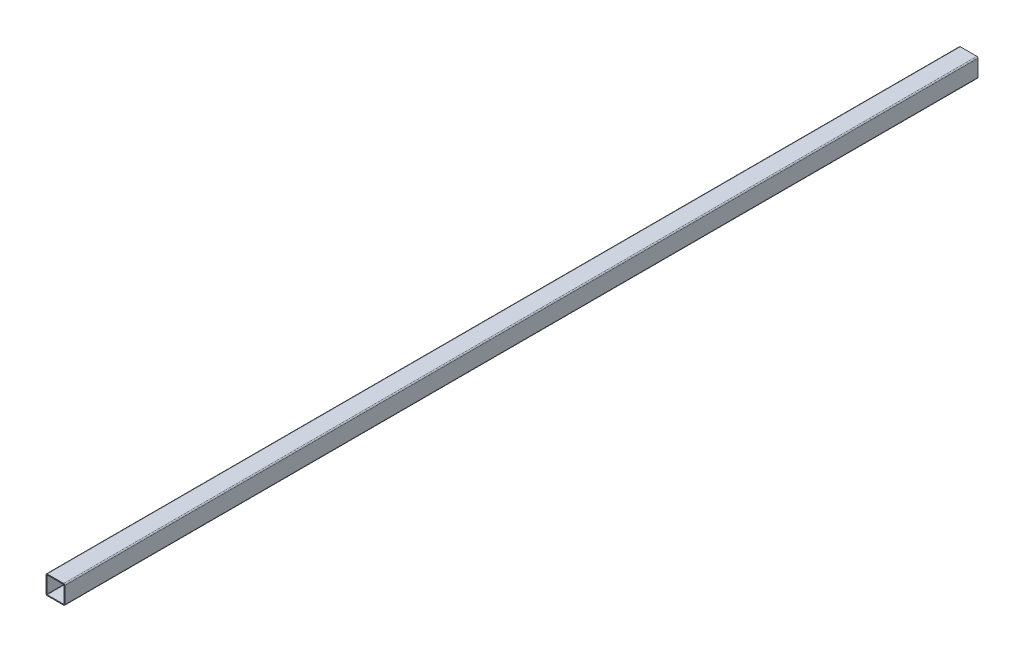
ISO-10303-21;
HEADER;
FILE_DESCRIPTION(('STEP AP214'),'2;1');
FILE_NAME('part.step','',(''),(''),'','','');
FILE_SCHEMA(('AUTOMOTIVE_DESIGN { 1 0 10303 214 1 1 1 1 }'));
ENDSEC;
DATA;
#1=APPLICATION_CONTEXT('core data for automotive mechanical design processes');
#2=APPLICATION_PROTOCOL_DEFINITION('international standard','automotive_design',2000,#1);
#3=PRODUCT_CONTEXT('',#1,'mechanical');
#4=PRODUCT('Part','Part','',(#3));
#5=PRODUCT_RELATED_PRODUCT_CATEGORY('part','',(#4));
#6=PRODUCT_DEFINITION_FORMATION('','',#4);
#7=PRODUCT_DEFINITION_CONTEXT('part definition',#1,'design');
#8=PRODUCT_DEFINITION('design','',#6,#7);
#9=PRODUCT_DEFINITION_SHAPE('','',#8);
#10=(LENGTH_UNIT() NAMED_UNIT(*) SI_UNIT(.MILLI.,.METRE.));
#11=(NAMED_UNIT(*) PLANE_ANGLE_UNIT() SI_UNIT($,.RADIAN.));
#12=(NAMED_UNIT(*) SI_UNIT($,.STERADIAN.) SOLID_ANGLE_UNIT());
#13=UNCERTAINTY_MEASURE_WITH_UNIT(LENGTH_MEASURE(1.E-05),#10,'distance_accuracy_value','');
#14=(GEOMETRIC_REPRESENTATION_CONTEXT(3) GLOBAL_UNCERTAINTY_ASSIGNED_CONTEXT((#13)) GLOBAL_UNIT_ASSIGNED_CONTEXT((#10,
#11,#12)) REPRESENTATION_CONTEXT('',''));
#15=CARTESIAN_POINT('',(0.,0.,0.));
#16=DIRECTION('',(0.,0.,1.));
#17=DIRECTION('',(1.,0.,0.));
#18=AXIS2_PLACEMENT_3D('',#15,#16,#17);
#19=CARTESIAN_POINT('',(14.,-14.,-774.));
#20=DIRECTION('',(0.,0.,1.));
#21=DIRECTION('',(1.,0.,0.));
#22=AXIS2_PLACEMENT_3D('',#19,#20,#21);
#23=CYLINDRICAL_SURFACE('',#22,2.);
#24=DIRECTION('',(0.,0.,1.));
#25=VECTOR('',#24,1.);
#26=CARTESIAN_POINT('',(16.,-14.,-774.));
#27=LINE('',#26,#25);
#28=CARTESIAN_POINT('',(16.,-14.,-774.));
#29=VERTEX_POINT('',#28);
#30=CARTESIAN_POINT('',(16.,-14.,774.));
#31=VERTEX_POINT('',#30);
#32=EDGE_CURVE('E37',#29,#31,#27,.T.);
#33=ORIENTED_EDGE('',*,*,#32,.T.);
#34=CARTESIAN_POINT('',(14.,-14.,774.));
#35=DIRECTION('',(0.,0.,1.));
#36=DIRECTION('',(1.,0.,0.));
#37=AXIS2_PLACEMENT_3D('',#34,#35,#36);
#38=CIRCLE('',#37,2.);
#39=CARTESIAN_POINT('',(14.,-16.,774.));
#40=VERTEX_POINT('',#39);
#41=EDGE_CURVE('E190',#40,#31,#38,.T.);
#42=ORIENTED_EDGE('',*,*,#41,.F.);
#43=DIRECTION('',(0.,0.,1.));
#44=VECTOR('',#43,1.);
#45=CARTESIAN_POINT('',(14.,-16.,-774.));
#46=LINE('',#45,#44);
#47=CARTESIAN_POINT('',(14.,-16.,-774.));
#48=VERTEX_POINT('',#47);
#49=EDGE_CURVE('E11',#48,#40,#46,.T.);
#50=ORIENTED_EDGE('',*,*,#49,.F.);
#51=CARTESIAN_POINT('',(14.,-14.,-774.));
#52=DIRECTION('',(0.,0.,1.));
#53=DIRECTION('',(1.,0.,0.));
#54=AXIS2_PLACEMENT_3D('',#51,#52,#53);
#55=CIRCLE('',#54,2.);
#56=EDGE_CURVE('E233',#48,#29,#55,.T.);
#57=ORIENTED_EDGE('',*,*,#56,.T.);
#58=EDGE_LOOP('',(#33,#42,#50,#57));
#59=FACE_BOUND('',#58,.T.);
#60=ADVANCED_FACE('F34',(#59),#23,.T.);
#61=CARTESIAN_POINT('',(-14.,-16.,-774.));
#62=DIRECTION('',(0.,-1.,0.));
#63=DIRECTION('',(0.,0.,-1.));
#64=AXIS2_PLACEMENT_3D('',#61,#62,#63);
#65=PLANE('',#64);
#66=ORIENTED_EDGE('',*,*,#49,.T.);
#67=DIRECTION('',(1.,0.,0.));
#68=VECTOR('',#67,1.);
#69=CARTESIAN_POINT('',(-14.,-16.,774.));
#70=LINE('',#69,#68);
#71=CARTESIAN_POINT('',(-14.,-16.,774.));
#72=VERTEX_POINT('',#71);
#73=EDGE_CURVE('E211',#72,#40,#70,.T.);
#74=ORIENTED_EDGE('',*,*,#73,.F.);
#75=DIRECTION('',(0.,0.,1.));
#76=VECTOR('',#75,1.);
#77=CARTESIAN_POINT('',(-14.,-16.,-774.));
#78=LINE('',#77,#76);
#79=CARTESIAN_POINT('',(-14.,-16.,-774.));
#80=VERTEX_POINT('',#79);
#81=EDGE_CURVE('E42',#80,#72,#78,.T.);
#82=ORIENTED_EDGE('',*,*,#81,.F.);
#83=DIRECTION('',(1.,0.,0.));
#84=VECTOR('',#83,1.);
#85=CARTESIAN_POINT('',(-14.,-16.,-774.));
#86=LINE('',#85,#84);
#87=EDGE_CURVE('E264',#80,#48,#86,.T.);
#88=ORIENTED_EDGE('',*,*,#87,.T.);
#89=EDGE_LOOP('',(#66,#74,#82,#88));
#90=FACE_BOUND('',#89,.T.);
#91=ADVANCED_FACE('F285',(#90),#65,.T.);
#92=CARTESIAN_POINT('',(-14.,-14.,-774.));
#93=DIRECTION('',(0.,0.,1.));
#94=DIRECTION('',(1.,0.,0.));
#95=AXIS2_PLACEMENT_3D('',#92,#93,#94);
#96=CYLINDRICAL_SURFACE('',#95,2.);
#97=ORIENTED_EDGE('',*,*,#81,.T.);
#98=CARTESIAN_POINT('',(-14.,-14.,774.));
#99=DIRECTION('',(0.,0.,1.));
#100=DIRECTION('',(1.,0.,0.));
#101=AXIS2_PLACEMENT_3D('',#98,#99,#100);
#102=CIRCLE('',#101,2.);
#103=CARTESIAN_POINT('',(-16.,-14.,774.));
#104=VERTEX_POINT('',#103);
#105=EDGE_CURVE('E208',#104,#72,#102,.T.);
#106=ORIENTED_EDGE('',*,*,#105,.F.);
#107=DIRECTION('',(0.,0.,1.));
#108=VECTOR('',#107,1.);
#109=CARTESIAN_POINT('',(-16.,-14.,-774.));
#110=LINE('',#109,#108);
#111=CARTESIAN_POINT('',(-16.,-14.,-774.));
#112=VERTEX_POINT('',#111);
#113=EDGE_CURVE('E268',#112,#104,#110,.T.);
#114=ORIENTED_EDGE('',*,*,#113,.F.);
#115=CARTESIAN_POINT('',(-14.,-14.,-774.));
#116=DIRECTION('',(0.,0.,1.));
#117=DIRECTION('',(1.,0.,0.));
#118=AXIS2_PLACEMENT_3D('',#115,#116,#117);
#119=CIRCLE('',#118,2.);
#120=EDGE_CURVE('E261',#112,#80,#119,.T.);
#121=ORIENTED_EDGE('',*,*,#120,.T.);
#122=EDGE_LOOP('',(#97,#106,#114,#121));
#123=FACE_BOUND('',#122,.T.);
#124=ADVANCED_FACE('F306',(#123),#96,.T.);
#125=CARTESIAN_POINT('',(-16.,-14.,-774.));
#126=DIRECTION('',(-1.,0.,0.));
#127=DIRECTION('',(0.,0.,1.));
#128=AXIS2_PLACEMENT_3D('',#125,#126,#127);
#129=PLANE('',#128);
#130=ORIENTED_EDGE('',*,*,#113,.T.);
#131=DIRECTION('',(0.,-1.,0.));
#132=VECTOR('',#131,1.);
#133=CARTESIAN_POINT('',(-16.,-14.,774.));
#134=LINE('',#133,#132);
#135=CARTESIAN_POINT('',(-16.,14.,774.));
#136=VERTEX_POINT('',#135);
#137=EDGE_CURVE('E205',#136,#104,#134,.T.);
#138=ORIENTED_EDGE('',*,*,#137,.F.);
#139=DIRECTION('',(0.,0.,1.));
#140=VECTOR('',#139,1.);
#141=CARTESIAN_POINT('',(-16.,14.,-774.));
#142=LINE('',#141,#140);
#143=CARTESIAN_POINT('',(-16.,14.,-774.));
#144=VERTEX_POINT('',#143);
#145=EDGE_CURVE('E270',#144,#136,#142,.T.);
#146=ORIENTED_EDGE('',*,*,#145,.F.);
#147=DIRECTION('',(0.,-1.,0.));
#148=VECTOR('',#147,1.);
#149=CARTESIAN_POINT('',(-16.,-14.,-774.));
#150=LINE('',#149,#148);
#151=EDGE_CURVE('E258',#144,#112,#150,.T.);
#152=ORIENTED_EDGE('',*,*,#151,.T.);
#153=EDGE_LOOP('',(#130,#138,#146,#152));
#154=FACE_BOUND('',#153,.T.);
#155=ADVANCED_FACE('F303',(#154),#129,.T.);
#156=CARTESIAN_POINT('',(-14.,14.,-774.));
#157=DIRECTION('',(0.,0.,1.));
#158=DIRECTION('',(1.,0.,0.));
#159=AXIS2_PLACEMENT_3D('',#156,#157,#158);
#160=CYLINDRICAL_SURFACE('',#159,2.);
#161=ORIENTED_EDGE('',*,*,#145,.T.);
#162=CARTESIAN_POINT('',(-14.,14.,774.));
#163=DIRECTION('',(0.,0.,1.));
#164=DIRECTION('',(-1.,0.,0.));
#165=AXIS2_PLACEMENT_3D('',#162,#163,#164);
#166=CIRCLE('',#165,2.);
#167=CARTESIAN_POINT('',(-14.,16.,774.));
#168=VERTEX_POINT('',#167);
#169=EDGE_CURVE('E202',#168,#136,#166,.T.);
#170=ORIENTED_EDGE('',*,*,#169,.F.);
#171=DIRECTION('',(0.,0.,1.));
#172=VECTOR('',#171,1.);
#173=CARTESIAN_POINT('',(-14.,16.,-774.));
#174=LINE('',#173,#172);
#175=CARTESIAN_POINT('',(-14.,16.,-774.));
#176=VERTEX_POINT('',#175);
#177=EDGE_CURVE('E272',#176,#168,#174,.T.);
#178=ORIENTED_EDGE('',*,*,#177,.F.);
#179=CARTESIAN_POINT('',(-14.,14.,-774.));
#180=DIRECTION('',(0.,0.,1.));
#181=DIRECTION('',(-1.,0.,0.));
#182=AXIS2_PLACEMENT_3D('',#179,#180,#181);
#183=CIRCLE('',#182,2.);
#184=EDGE_CURVE('E255',#176,#144,#183,.T.);
#185=ORIENTED_EDGE('',*,*,#184,.T.);
#186=EDGE_LOOP('',(#161,#170,#178,#185));
#187=FACE_BOUND('',#186,.T.);
#188=ADVANCED_FACE('F301',(#187),#160,.T.);
#189=CARTESIAN_POINT('',(-14.,16.,-774.));
#190=DIRECTION('',(0.,1.,0.));
#191=DIRECTION('',(0.,0.,1.));
#192=AXIS2_PLACEMENT_3D('',#189,#190,#191);
#193=PLANE('',#192);
#194=ORIENTED_EDGE('',*,*,#177,.T.);
#195=DIRECTION('',(-1.,0.,0.));
#196=VECTOR('',#195,1.);
#197=CARTESIAN_POINT('',(-14.,16.,774.));
#198=LINE('',#197,#196);
#199=CARTESIAN_POINT('',(14.,16.,774.));
#200=VERTEX_POINT('',#199);
#201=EDGE_CURVE('E199',#200,#168,#198,.T.);
#202=ORIENTED_EDGE('',*,*,#201,.F.);
#203=DIRECTION('',(0.,0.,1.));
#204=VECTOR('',#203,1.);
#205=CARTESIAN_POINT('',(14.,16.,-774.));
#206=LINE('',#205,#204);
#207=CARTESIAN_POINT('',(14.,16.,-774.));
#208=VERTEX_POINT('',#207);
#209=EDGE_CURVE('E274',#208,#200,#206,.T.);
#210=ORIENTED_EDGE('',*,*,#209,.F.);
#211=DIRECTION('',(-1.,0.,0.));
#212=VECTOR('',#211,1.);
#213=CARTESIAN_POINT('',(-14.,16.,-774.));
#214=LINE('',#213,#212);
#215=EDGE_CURVE('E252',#208,#176,#214,.T.);
#216=ORIENTED_EDGE('',*,*,#215,.T.);
#217=EDGE_LOOP('',(#194,#202,#210,#216));
#218=FACE_BOUND('',#217,.T.);
#219=ADVANCED_FACE('F299',(#218),#193,.T.);
#220=CARTESIAN_POINT('',(14.,14.,-774.));
#221=DIRECTION('',(0.,0.,1.));
#222=DIRECTION('',(1.,0.,0.));
#223=AXIS2_PLACEMENT_3D('',#220,#221,#222);
#224=CYLINDRICAL_SURFACE('',#223,2.);
#225=ORIENTED_EDGE('',*,*,#209,.T.);
#226=CARTESIAN_POINT('',(14.,14.,774.));
#227=DIRECTION('',(0.,0.,1.));
#228=DIRECTION('',(1.,0.,0.));
#229=AXIS2_PLACEMENT_3D('',#226,#227,#228);
#230=CIRCLE('',#229,2.);
#231=CARTESIAN_POINT('',(16.,14.,774.));
#232=VERTEX_POINT('',#231);
#233=EDGE_CURVE('E196',#232,#200,#230,.T.);
#234=ORIENTED_EDGE('',*,*,#233,.F.);
#235=DIRECTION('',(0.,0.,1.));
#236=VECTOR('',#235,1.);
#237=CARTESIAN_POINT('',(16.,14.,-774.));
#238=LINE('',#237,#236);
#239=CARTESIAN_POINT('',(16.,14.,-774.));
#240=VERTEX_POINT('',#239);
#241=EDGE_CURVE('E275',#240,#232,#238,.T.);
#242=ORIENTED_EDGE('',*,*,#241,.F.);
#243=CARTESIAN_POINT('',(14.,14.,-774.));
#244=DIRECTION('',(0.,0.,1.));
#245=DIRECTION('',(1.,0.,0.));
#246=AXIS2_PLACEMENT_3D('',#243,#244,#245);
#247=CIRCLE('',#246,2.);
#248=EDGE_CURVE('E249',#240,#208,#247,.T.);
#249=ORIENTED_EDGE('',*,*,#248,.T.);
#250=EDGE_LOOP('',(#225,#234,#242,#249));
#251=FACE_BOUND('',#250,.T.);
#252=ADVANCED_FACE('F295',(#251),#224,.T.);
#253=CARTESIAN_POINT('',(16.,-14.,-774.));
#254=DIRECTION('',(1.,0.,0.));
#255=DIRECTION('',(0.,0.,-1.));
#256=AXIS2_PLACEMENT_3D('',#253,#254,#255);
#257=PLANE('',#256);
#258=ORIENTED_EDGE('',*,*,#241,.T.);
#259=DIRECTION('',(0.,1.,0.));
#260=VECTOR('',#259,1.);
#261=CARTESIAN_POINT('',(16.,-14.,774.));
#262=LINE('',#261,#260);
#263=EDGE_CURVE('E193',#31,#232,#262,.T.);
#264=ORIENTED_EDGE('',*,*,#263,.F.);
#265=ORIENTED_EDGE('',*,*,#32,.F.);
#266=DIRECTION('',(0.,1.,0.));
#267=VECTOR('',#266,1.);
#268=CARTESIAN_POINT('',(16.,-14.,-774.));
#269=LINE('',#268,#267);
#270=EDGE_CURVE('E246',#29,#240,#269,.T.);
#271=ORIENTED_EDGE('',*,*,#270,.T.);
#272=EDGE_LOOP('',(#258,#264,#265,#271));
#273=FACE_BOUND('',#272,.T.);
#274=ADVANCED_FACE('F279',(#273),#257,.T.);
#275=CARTESIAN_POINT('',(14.,-14.,-774.));
#276=DIRECTION('',(0.,0.,1.));
#277=DIRECTION('',(1.,0.,0.));
#278=AXIS2_PLACEMENT_3D('',#275,#276,#277);
#279=PLANE('',#278);
#280=DIRECTION('',(-1.,0.,0.));
#281=VECTOR('',#280,1.);
#282=CARTESIAN_POINT('',(-14.,14.48,-774.));
#283=LINE('',#282,#281);
#284=CARTESIAN_POINT('',(14.,14.48,-774.));
#285=VERTEX_POINT('',#284);
#286=CARTESIAN_POINT('',(-14.,14.48,-774.));
#287=VERTEX_POINT('',#286);
#288=EDGE_CURVE('E159',#285,#287,#283,.T.);
#289=ORIENTED_EDGE('',*,*,#288,.T.);
#290=CARTESIAN_POINT('',(-14.,14.,-774.));
#291=DIRECTION('',(0.,0.,1.));
#292=DIRECTION('',(-1.,0.,0.));
#293=AXIS2_PLACEMENT_3D('',#290,#291,#292);
#294=CIRCLE('',#293,0.48);
#295=CARTESIAN_POINT('',(-14.48,14.,-774.));
#296=VERTEX_POINT('',#295);
#297=EDGE_CURVE('E214',#287,#296,#294,.T.);
#298=ORIENTED_EDGE('',*,*,#297,.T.);
#299=DIRECTION('',(0.,-1.,0.));
#300=VECTOR('',#299,1.);
#301=CARTESIAN_POINT('',(-14.48,-14.,-774.));
#302=LINE('',#301,#300);
#303=CARTESIAN_POINT('',(-14.48,-14.,-774.));
#304=VERTEX_POINT('',#303);
#305=EDGE_CURVE('E154',#296,#304,#302,.T.);
#306=ORIENTED_EDGE('',*,*,#305,.T.);
#307=CARTESIAN_POINT('',(-14.,-14.,-774.));
#308=DIRECTION('',(0.,0.,1.));
#309=DIRECTION('',(1.,0.,0.));
#310=AXIS2_PLACEMENT_3D('',#307,#308,#309);
#311=CIRCLE('',#310,0.48);
#312=CARTESIAN_POINT('',(-14.,-14.48,-774.));
#313=VERTEX_POINT('',#312);
#314=EDGE_CURVE('E50',#304,#313,#311,.T.);
#315=ORIENTED_EDGE('',*,*,#314,.T.);
#316=DIRECTION('',(1.,0.,0.));
#317=VECTOR('',#316,1.);
#318=CARTESIAN_POINT('',(-14.,-14.48,-774.));
#319=LINE('',#318,#317);
#320=CARTESIAN_POINT('',(14.,-14.48,-774.));
#321=VERTEX_POINT('',#320);
#322=EDGE_CURVE('E218',#313,#321,#319,.T.);
#323=ORIENTED_EDGE('',*,*,#322,.T.);
#324=CARTESIAN_POINT('',(14.,-14.,-774.));
#325=DIRECTION('',(0.,0.,1.));
#326=DIRECTION('',(1.,0.,0.));
#327=AXIS2_PLACEMENT_3D('',#324,#325,#326);
#328=CIRCLE('',#327,0.48);
#329=CARTESIAN_POINT('',(14.48,-14.,-774.));
#330=VERTEX_POINT('',#329);
#331=EDGE_CURVE('E221',#321,#330,#328,.T.);
#332=ORIENTED_EDGE('',*,*,#331,.T.);
#333=DIRECTION('',(0.,1.,0.));
#334=VECTOR('',#333,1.);
#335=CARTESIAN_POINT('',(14.48,-14.,-774.));
#336=LINE('',#335,#334);
#337=CARTESIAN_POINT('',(14.48,14.,-774.));
#338=VERTEX_POINT('',#337);
#339=EDGE_CURVE('E224',#330,#338,#336,.T.);
#340=ORIENTED_EDGE('',*,*,#339,.T.);
#341=CARTESIAN_POINT('',(14.,14.,-774.));
#342=DIRECTION('',(0.,0.,1.));
#343=DIRECTION('',(1.,0.,0.));
#344=AXIS2_PLACEMENT_3D('',#341,#342,#343);
#345=CIRCLE('',#344,0.48);
#346=EDGE_CURVE('E227',#338,#285,#345,.T.);
#347=ORIENTED_EDGE('',*,*,#346,.T.);
#348=EDGE_LOOP('',(#289,#298,#306,#315,#323,#332,#340,#347));
#349=FACE_BOUND('',#348,.T.);
#350=ORIENTED_EDGE('',*,*,#56,.F.);
#351=ORIENTED_EDGE('',*,*,#87,.F.);
#352=ORIENTED_EDGE('',*,*,#120,.F.);
#353=ORIENTED_EDGE('',*,*,#151,.F.);
#354=ORIENTED_EDGE('',*,*,#184,.F.);
#355=ORIENTED_EDGE('',*,*,#215,.F.);
#356=ORIENTED_EDGE('',*,*,#248,.F.);
#357=ORIENTED_EDGE('',*,*,#270,.F.);
#358=EDGE_LOOP('',(#350,#351,#352,#353,#354,#355,#356,#357));
#359=FACE_BOUND('',#358,.T.);
#360=ADVANCED_FACE('F289',(#349,#359),#279,.F.);
#361=CARTESIAN_POINT('',(-14.,14.,-774.));
#362=DIRECTION('',(0.,0.,1.));
#363=DIRECTION('',(1.,0.,0.));
#364=AXIS2_PLACEMENT_3D('',#361,#362,#363);
#365=CYLINDRICAL_SURFACE('',#364,0.48);
#366=DIRECTION('',(0.,0.,1.));
#367=VECTOR('',#366,1.);
#368=CARTESIAN_POINT('',(-14.,14.48,-774.));
#369=LINE('',#368,#367);
#370=CARTESIAN_POINT('',(-14.,14.48,774.));
#371=VERTEX_POINT('',#370);
#372=EDGE_CURVE('E164',#287,#371,#369,.T.);
#373=ORIENTED_EDGE('',*,*,#372,.T.);
#374=CARTESIAN_POINT('',(-14.,14.,774.));
#375=DIRECTION('',(0.,0.,1.));
#376=DIRECTION('',(-1.,0.,0.));
#377=AXIS2_PLACEMENT_3D('',#374,#375,#376);
#378=CIRCLE('',#377,0.48);
#379=CARTESIAN_POINT('',(-14.48,14.,774.));
#380=VERTEX_POINT('',#379);
#381=EDGE_CURVE('E162',#371,#380,#378,.T.);
#382=ORIENTED_EDGE('',*,*,#381,.T.);
#383=DIRECTION('',(0.,0.,1.));
#384=VECTOR('',#383,1.);
#385=CARTESIAN_POINT('',(-14.48,14.,-774.));
#386=LINE('',#385,#384);
#387=EDGE_CURVE('E147',#296,#380,#386,.T.);
#388=ORIENTED_EDGE('',*,*,#387,.F.);
#389=ORIENTED_EDGE('',*,*,#297,.F.);
#390=EDGE_LOOP('',(#373,#382,#388,#389));
#391=FACE_BOUND('',#390,.T.);
#392=ADVANCED_FACE('F163',(#391),#365,.F.);
#393=CARTESIAN_POINT('',(-14.,14.48,-774.));
#394=DIRECTION('',(0.,1.,0.));
#395=DIRECTION('',(0.,0.,1.));
#396=AXIS2_PLACEMENT_3D('',#393,#394,#395);
#397=PLANE('',#396);
#398=DIRECTION('',(0.,0.,1.));
#399=VECTOR('',#398,1.);
#400=CARTESIAN_POINT('',(14.,14.48,-774.));
#401=LINE('',#400,#399);
#402=CARTESIAN_POINT('',(14.,14.48,774.));
#403=VERTEX_POINT('',#402);
#404=EDGE_CURVE('E234',#285,#403,#401,.T.);
#405=ORIENTED_EDGE('',*,*,#404,.T.);
#406=DIRECTION('',(-1.,0.,0.));
#407=VECTOR('',#406,1.);
#408=CARTESIAN_POINT('',(-14.,14.48,774.));
#409=LINE('',#408,#407);
#410=EDGE_CURVE('E188',#403,#371,#409,.T.);
#411=ORIENTED_EDGE('',*,*,#410,.T.);
#412=ORIENTED_EDGE('',*,*,#372,.F.);
#413=ORIENTED_EDGE('',*,*,#288,.F.);
#414=EDGE_LOOP('',(#405,#411,#412,#413));
#415=FACE_BOUND('',#414,.T.);
#416=ADVANCED_FACE('F381',(#415),#397,.F.);
#417=CARTESIAN_POINT('',(14.,14.,-774.));
#418=DIRECTION('',(0.,0.,1.));
#419=DIRECTION('',(1.,0.,0.));
#420=AXIS2_PLACEMENT_3D('',#417,#418,#419);
#421=CYLINDRICAL_SURFACE('',#420,0.48);
#422=DIRECTION('',(0.,0.,1.));
#423=VECTOR('',#422,1.);
#424=CARTESIAN_POINT('',(14.48,14.,-774.));
#425=LINE('',#424,#423);
#426=CARTESIAN_POINT('',(14.48,14.,774.));
#427=VERTEX_POINT('',#426);
#428=EDGE_CURVE('E236',#338,#427,#425,.T.);
#429=ORIENTED_EDGE('',*,*,#428,.T.);
#430=CARTESIAN_POINT('',(14.,14.,774.));
#431=DIRECTION('',(0.,0.,1.));
#432=DIRECTION('',(1.,0.,0.));
#433=AXIS2_PLACEMENT_3D('',#430,#431,#432);
#434=CIRCLE('',#433,0.48);
#435=EDGE_CURVE('E185',#427,#403,#434,.T.);
#436=ORIENTED_EDGE('',*,*,#435,.T.);
#437=ORIENTED_EDGE('',*,*,#404,.F.);
#438=ORIENTED_EDGE('',*,*,#346,.F.);
#439=EDGE_LOOP('',(#429,#436,#437,#438));
#440=FACE_BOUND('',#439,.T.);
#441=ADVANCED_FACE('F390',(#440),#421,.F.);
#442=CARTESIAN_POINT('',(14.48,-14.,-774.));
#443=DIRECTION('',(1.,0.,0.));
#444=DIRECTION('',(0.,0.,-1.));
#445=AXIS2_PLACEMENT_3D('',#442,#443,#444);
#446=PLANE('',#445);
#447=DIRECTION('',(0.,0.,1.));
#448=VECTOR('',#447,1.);
#449=CARTESIAN_POINT('',(14.48,-14.,-774.));
#450=LINE('',#449,#448);
#451=CARTESIAN_POINT('',(14.48,-14.,774.));
#452=VERTEX_POINT('',#451);
#453=EDGE_CURVE('E238',#330,#452,#450,.T.);
#454=ORIENTED_EDGE('',*,*,#453,.T.);
#455=DIRECTION('',(0.,1.,0.));
#456=VECTOR('',#455,1.);
#457=CARTESIAN_POINT('',(14.48,-14.,774.));
#458=LINE('',#457,#456);
#459=EDGE_CURVE('E182',#452,#427,#458,.T.);
#460=ORIENTED_EDGE('',*,*,#459,.T.);
#461=ORIENTED_EDGE('',*,*,#428,.F.);
#462=ORIENTED_EDGE('',*,*,#339,.F.);
#463=EDGE_LOOP('',(#454,#460,#461,#462));
#464=FACE_BOUND('',#463,.T.);
#465=ADVANCED_FACE('F400',(#464),#446,.F.);
#466=CARTESIAN_POINT('',(14.,-14.,-774.));
#467=DIRECTION('',(0.,0.,1.));
#468=DIRECTION('',(1.,0.,0.));
#469=AXIS2_PLACEMENT_3D('',#466,#467,#468);
#470=CYLINDRICAL_SURFACE('',#469,0.48);
#471=DIRECTION('',(0.,0.,1.));
#472=VECTOR('',#471,1.);
#473=CARTESIAN_POINT('',(14.,-14.48,-774.));
#474=LINE('',#473,#472);
#475=CARTESIAN_POINT('',(14.,-14.48,774.));
#476=VERTEX_POINT('',#475);
#477=EDGE_CURVE('E240',#321,#476,#474,.T.);
#478=ORIENTED_EDGE('',*,*,#477,.T.);
#479=CARTESIAN_POINT('',(14.,-14.,774.));
#480=DIRECTION('',(0.,0.,1.));
#481=DIRECTION('',(1.,0.,0.));
#482=AXIS2_PLACEMENT_3D('',#479,#480,#481);
#483=CIRCLE('',#482,0.48);
#484=EDGE_CURVE('E179',#476,#452,#483,.T.);
#485=ORIENTED_EDGE('',*,*,#484,.T.);
#486=ORIENTED_EDGE('',*,*,#453,.F.);
#487=ORIENTED_EDGE('',*,*,#331,.F.);
#488=EDGE_LOOP('',(#478,#485,#486,#487));
#489=FACE_BOUND('',#488,.T.);
#490=ADVANCED_FACE('F410',(#489),#470,.F.);
#491=CARTESIAN_POINT('',(-14.,-14.48,-774.));
#492=DIRECTION('',(0.,-1.,0.));
#493=DIRECTION('',(0.,0.,-1.));
#494=AXIS2_PLACEMENT_3D('',#491,#492,#493);
#495=PLANE('',#494);
#496=DIRECTION('',(0.,0.,1.));
#497=VECTOR('',#496,1.);
#498=CARTESIAN_POINT('',(-14.,-14.48,-774.));
#499=LINE('',#498,#497);
#500=CARTESIAN_POINT('',(-14.,-14.48,774.));
#501=VERTEX_POINT('',#500);
#502=EDGE_CURVE('E242',#313,#501,#499,.T.);
#503=ORIENTED_EDGE('',*,*,#502,.T.);
#504=DIRECTION('',(1.,0.,0.));
#505=VECTOR('',#504,1.);
#506=CARTESIAN_POINT('',(-14.,-14.48,774.));
#507=LINE('',#506,#505);
#508=EDGE_CURVE('E174',#501,#476,#507,.T.);
#509=ORIENTED_EDGE('',*,*,#508,.T.);
#510=ORIENTED_EDGE('',*,*,#477,.F.);
#511=ORIENTED_EDGE('',*,*,#322,.F.);
#512=EDGE_LOOP('',(#503,#509,#510,#511));
#513=FACE_BOUND('',#512,.T.);
#514=ADVANCED_FACE('F420',(#513),#495,.F.);
#515=CARTESIAN_POINT('',(-14.,-14.,-774.));
#516=DIRECTION('',(0.,0.,1.));
#517=DIRECTION('',(1.,0.,0.));
#518=AXIS2_PLACEMENT_3D('',#515,#516,#517);
#519=CYLINDRICAL_SURFACE('',#518,0.48);
#520=DIRECTION('',(0.,0.,1.));
#521=VECTOR('',#520,1.);
#522=CARTESIAN_POINT('',(-14.48,-14.,-774.));
#523=LINE('',#522,#521);
#524=CARTESIAN_POINT('',(-14.48,-14.,774.));
#525=VERTEX_POINT('',#524);
#526=EDGE_CURVE('E158',#304,#525,#523,.T.);
#527=ORIENTED_EDGE('',*,*,#526,.T.);
#528=CARTESIAN_POINT('',(-14.,-14.,774.));
#529=DIRECTION('',(0.,0.,1.));
#530=DIRECTION('',(1.,0.,0.));
#531=AXIS2_PLACEMENT_3D('',#528,#529,#530);
#532=CIRCLE('',#531,0.48);
#533=EDGE_CURVE('E172',#525,#501,#532,.T.);
#534=ORIENTED_EDGE('',*,*,#533,.T.);
#535=ORIENTED_EDGE('',*,*,#502,.F.);
#536=ORIENTED_EDGE('',*,*,#314,.F.);
#537=EDGE_LOOP('',(#527,#534,#535,#536));
#538=FACE_BOUND('',#537,.T.);
#539=ADVANCED_FACE('F430',(#538),#519,.F.);
#540=CARTESIAN_POINT('',(-14.48,-14.,-774.));
#541=DIRECTION('',(-1.,0.,0.));
#542=DIRECTION('',(0.,0.,1.));
#543=AXIS2_PLACEMENT_3D('',#540,#541,#542);
#544=PLANE('',#543);
#545=ORIENTED_EDGE('',*,*,#387,.T.);
#546=DIRECTION('',(0.,-1.,0.));
#547=VECTOR('',#546,1.);
#548=CARTESIAN_POINT('',(-14.48,-14.,774.));
#549=LINE('',#548,#547);
#550=EDGE_CURVE('E151',#380,#525,#549,.T.);
#551=ORIENTED_EDGE('',*,*,#550,.T.);
#552=ORIENTED_EDGE('',*,*,#526,.F.);
#553=ORIENTED_EDGE('',*,*,#305,.F.);
#554=EDGE_LOOP('',(#545,#551,#552,#553));
#555=FACE_BOUND('',#554,.T.);
#556=ADVANCED_FACE('F149',(#555),#544,.F.);
#557=CARTESIAN_POINT('',(14.,-14.,774.));
#558=DIRECTION('',(0.,0.,1.));
#559=DIRECTION('',(1.,0.,0.));
#560=AXIS2_PLACEMENT_3D('',#557,#558,#559);
#561=PLANE('',#560);
#562=ORIENTED_EDGE('',*,*,#41,.T.);
#563=ORIENTED_EDGE('',*,*,#263,.T.);
#564=ORIENTED_EDGE('',*,*,#233,.T.);
#565=ORIENTED_EDGE('',*,*,#201,.T.);
#566=ORIENTED_EDGE('',*,*,#169,.T.);
#567=ORIENTED_EDGE('',*,*,#137,.T.);
#568=ORIENTED_EDGE('',*,*,#105,.T.);
#569=ORIENTED_EDGE('',*,*,#73,.T.);
#570=EDGE_LOOP('',(#562,#563,#564,#565,#566,#567,#568,#569));
#571=FACE_BOUND('',#570,.T.);
#572=ORIENTED_EDGE('',*,*,#550,.F.);
#573=ORIENTED_EDGE('',*,*,#381,.F.);
#574=ORIENTED_EDGE('',*,*,#410,.F.);
#575=ORIENTED_EDGE('',*,*,#435,.F.);
#576=ORIENTED_EDGE('',*,*,#459,.F.);
#577=ORIENTED_EDGE('',*,*,#484,.F.);
#578=ORIENTED_EDGE('',*,*,#508,.F.);
#579=ORIENTED_EDGE('',*,*,#533,.F.);
#580=EDGE_LOOP('',(#572,#573,#574,#575,#576,#577,#578,#579));
#581=FACE_BOUND('',#580,.T.);
#582=ADVANCED_FACE('F169',(#571,#581),#561,.T.);
#583=CLOSED_SHELL('',(#60,#91,#124,#155,#188,#219,#252,#274,#360,#392,#416,#441,#465,#490,#514,
#539,#556,#582));
#584=MANIFOLD_SOLID_BREP('B2',#583);
#585=ADVANCED_BREP_SHAPE_REPRESENTATION('',(#18,#584),#14);
#586=SHAPE_DEFINITION_REPRESENTATION(#9,#585);
ENDSEC;
END-ISO-10303-21;
